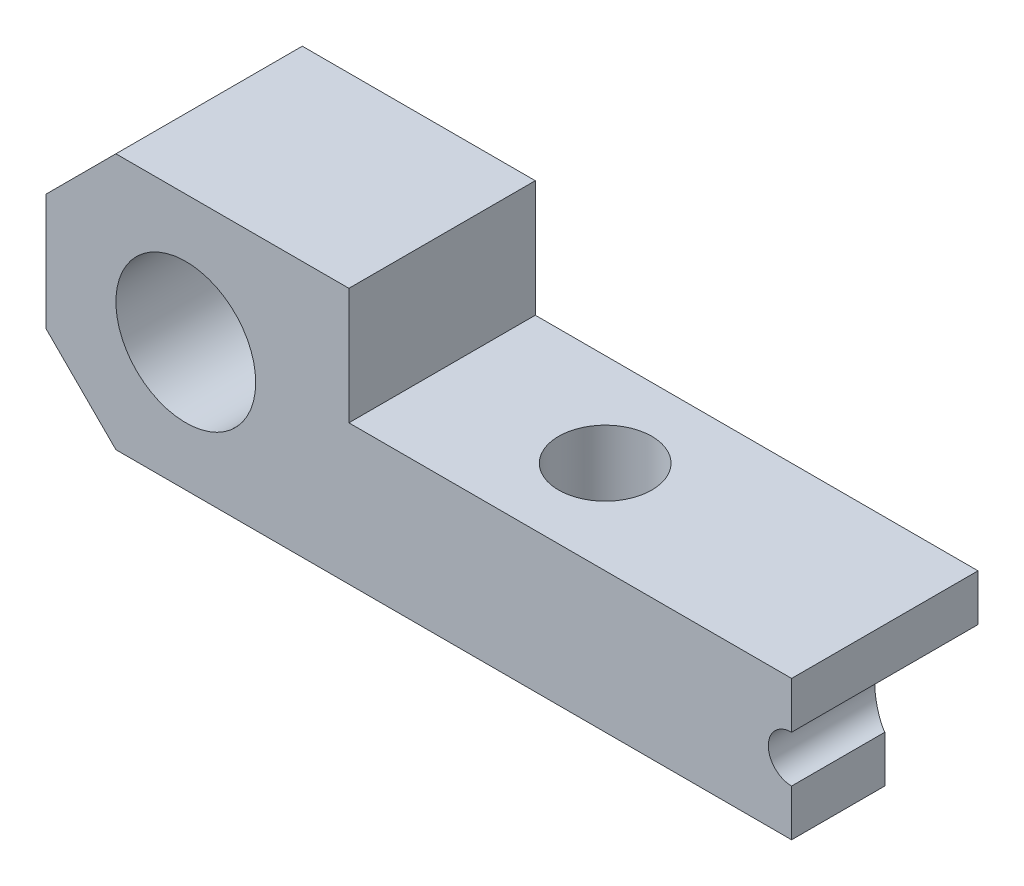
ISO-10303-21;
HEADER;
FILE_DESCRIPTION(('STEP AP214'),'2;1');
FILE_NAME('part.step','',(''),(''),'','','');
FILE_SCHEMA(('AUTOMOTIVE_DESIGN { 1 0 10303 214 1 1 1 1 }'));
ENDSEC;
DATA;
#1=APPLICATION_CONTEXT('core data for automotive mechanical design processes');
#2=APPLICATION_PROTOCOL_DEFINITION('international standard','automotive_design',2000,#1);
#3=PRODUCT_CONTEXT('',#1,'mechanical');
#4=PRODUCT('Part','Part','',(#3));
#5=PRODUCT_RELATED_PRODUCT_CATEGORY('part','',(#4));
#6=PRODUCT_DEFINITION_FORMATION('','',#4);
#7=PRODUCT_DEFINITION_CONTEXT('part definition',#1,'design');
#8=PRODUCT_DEFINITION('design','',#6,#7);
#9=PRODUCT_DEFINITION_SHAPE('','',#8);
#10=(LENGTH_UNIT() NAMED_UNIT(*) SI_UNIT(.MILLI.,.METRE.));
#11=(NAMED_UNIT(*) PLANE_ANGLE_UNIT() SI_UNIT($,.RADIAN.));
#12=(NAMED_UNIT(*) SI_UNIT($,.STERADIAN.) SOLID_ANGLE_UNIT());
#13=UNCERTAINTY_MEASURE_WITH_UNIT(LENGTH_MEASURE(1.E-05),#10,'distance_accuracy_value','');
#14=(GEOMETRIC_REPRESENTATION_CONTEXT(3) GLOBAL_UNCERTAINTY_ASSIGNED_CONTEXT((#13)) GLOBAL_UNIT_ASSIGNED_CONTEXT((#10,
#11,#12)) REPRESENTATION_CONTEXT('',''));
#15=CARTESIAN_POINT('',(0.,0.,0.));
#16=DIRECTION('',(0.,0.,1.));
#17=DIRECTION('',(1.,0.,0.));
#18=AXIS2_PLACEMENT_3D('',#15,#16,#17);
#19=CARTESIAN_POINT('',(32.,0.,8.));
#20=DIRECTION('',(-1.,0.,0.));
#21=DIRECTION('',(0.,0.,1.));
#22=AXIS2_PLACEMENT_3D('',#19,#20,#21);
#23=PLANE('',#22);
#24=DIRECTION('',(0.,0.,-1.));
#25=VECTOR('',#24,1.);
#26=CARTESIAN_POINT('',(32.,0.,8.));
#27=LINE('',#26,#25);
#28=CARTESIAN_POINT('',(32.,0.,8.));
#29=VERTEX_POINT('',#28);
#30=CARTESIAN_POINT('',(32.,0.,4.));
#31=VERTEX_POINT('',#30);
#32=EDGE_CURVE('E152',#29,#31,#27,.T.);
#33=ORIENTED_EDGE('',*,*,#32,.T.);
#34=DIRECTION('',(0.,-1.,0.));
#35=VECTOR('',#34,1.);
#36=CARTESIAN_POINT('',(32.,4.,4.));
#37=LINE('',#36,#35);
#38=CARTESIAN_POINT('',(32.,2.,4.));
#39=VERTEX_POINT('',#38);
#40=EDGE_CURVE('E137',#39,#31,#37,.T.);
#41=ORIENTED_EDGE('',*,*,#40,.F.);
#42=DIRECTION('',(0.,0.,1.));
#43=VECTOR('',#42,1.);
#44=CARTESIAN_POINT('',(32.,2.,0.));
#45=LINE('',#44,#43);
#46=CARTESIAN_POINT('',(32.,2.,8.));
#47=VERTEX_POINT('',#46);
#48=EDGE_CURVE('E145',#39,#47,#45,.T.);
#49=ORIENTED_EDGE('',*,*,#48,.T.);
#50=DIRECTION('',(0.,1.,0.));
#51=VECTOR('',#50,1.);
#52=CARTESIAN_POINT('',(32.,0.,8.));
#53=LINE('',#52,#51);
#54=EDGE_CURVE('E241',#29,#47,#53,.T.);
#55=ORIENTED_EDGE('',*,*,#54,.F.);
#56=EDGE_LOOP('',(#33,#41,#49,#55));
#57=FACE_BOUND('',#56,.T.);
#58=ADVANCED_FACE('F31',(#57),#23,.F.);
#59=CARTESIAN_POINT('',(0.,6.,8.));
#60=DIRECTION('',(0.,0.,1.));
#61=DIRECTION('',(1.,0.,0.));
#62=AXIS2_PLACEMENT_3D('',#59,#60,#61);
#63=PLANE('',#62);
#64=DIRECTION('',(0.,-1.,0.));
#65=VECTOR('',#64,1.);
#66=CARTESIAN_POINT('',(0.,0.,8.));
#67=LINE('',#66,#65);
#68=CARTESIAN_POINT('',(0.,8.00000000000001,8.));
#69=VERTEX_POINT('',#68);
#70=CARTESIAN_POINT('',(0.,3.00000000000001,8.));
#71=VERTEX_POINT('',#70);
#72=EDGE_CURVE('E184',#69,#71,#67,.T.);
#73=ORIENTED_EDGE('',*,*,#72,.T.);
#74=DIRECTION('',(-0.707106781186547,0.707106781186548,0.));
#75=VECTOR('',#74,1.);
#76=CARTESIAN_POINT('',(-1.5,4.50000000000001,8.));
#77=LINE('',#76,#75);
#78=CARTESIAN_POINT('',(3.,0.,8.));
#79=VERTEX_POINT('',#78);
#80=EDGE_CURVE('E39',#71,#79,#77,.F.);
#81=ORIENTED_EDGE('',*,*,#80,.T.);
#82=DIRECTION('',(1.,0.,0.));
#83=VECTOR('',#82,1.);
#84=CARTESIAN_POINT('',(0.,0.,8.));
#85=LINE('',#84,#83);
#86=EDGE_CURVE('E182',#79,#29,#85,.T.);
#87=ORIENTED_EDGE('',*,*,#86,.T.);
#88=ORIENTED_EDGE('',*,*,#54,.T.);
#89=CARTESIAN_POINT('',(32.,3.,8.));
#90=DIRECTION('',(0.,0.,1.));
#91=DIRECTION('',(1.,0.,0.));
#92=AXIS2_PLACEMENT_3D('',#89,#90,#91);
#93=CIRCLE('',#92,0.999999999999998);
#94=CARTESIAN_POINT('',(32.,4.,8.));
#95=VERTEX_POINT('',#94);
#96=EDGE_CURVE('E247',#95,#47,#93,.T.);
#97=ORIENTED_EDGE('',*,*,#96,.F.);
#98=CARTESIAN_POINT('',(32.,6.,8.));
#99=VERTEX_POINT('',#98);
#100=EDGE_CURVE('E151',#95,#99,#53,.T.);
#101=ORIENTED_EDGE('',*,*,#100,.T.);
#102=DIRECTION('',(-1.,0.,0.));
#103=VECTOR('',#102,1.);
#104=CARTESIAN_POINT('',(32.,6.,8.));
#105=LINE('',#104,#103);
#106=CARTESIAN_POINT('',(13.,6.,8.));
#107=VERTEX_POINT('',#106);
#108=EDGE_CURVE('E231',#99,#107,#105,.T.);
#109=ORIENTED_EDGE('',*,*,#108,.T.);
#110=DIRECTION('',(0.,1.,0.));
#111=VECTOR('',#110,1.);
#112=CARTESIAN_POINT('',(13.,11.,8.));
#113=LINE('',#112,#111);
#114=CARTESIAN_POINT('',(13.,11.,8.));
#115=VERTEX_POINT('',#114);
#116=EDGE_CURVE('E240',#107,#115,#113,.T.);
#117=ORIENTED_EDGE('',*,*,#116,.T.);
#118=DIRECTION('',(-1.,0.,0.));
#119=VECTOR('',#118,1.);
#120=CARTESIAN_POINT('',(0.,11.,8.));
#121=LINE('',#120,#119);
#122=CARTESIAN_POINT('',(3.,11.,8.));
#123=VERTEX_POINT('',#122);
#124=EDGE_CURVE('E210',#115,#123,#121,.T.);
#125=ORIENTED_EDGE('',*,*,#124,.T.);
#126=DIRECTION('',(0.707106781186549,0.707106781186546,0.));
#127=VECTOR('',#126,1.);
#128=CARTESIAN_POINT('',(-1.00000000000001,7.,8.));
#129=LINE('',#128,#127);
#130=EDGE_CURVE('E175',#123,#69,#129,.F.);
#131=ORIENTED_EDGE('',*,*,#130,.T.);
#132=EDGE_LOOP('',(#73,#81,#87,#88,#97,#101,#109,#117,#125,#131));
#133=FACE_BOUND('',#132,.T.);
#134=CARTESIAN_POINT('',(6.,5.5,8.));
#135=DIRECTION('',(0.,0.,1.));
#136=DIRECTION('',(1.,0.,0.));
#137=AXIS2_PLACEMENT_3D('',#134,#135,#136);
#138=CIRCLE('',#137,3.);
#139=CARTESIAN_POINT('',(9.,5.5,8.));
#140=VERTEX_POINT('',#139);
#141=EDGE_CURVE('E202',#140,#140,#138,.T.);
#142=ORIENTED_EDGE('',*,*,#141,.F.);
#143=EDGE_LOOP('',(#142));
#144=FACE_BOUND('',#143,.T.);
#145=ADVANCED_FACE('F179',(#133,#144),#63,.T.);
#146=CARTESIAN_POINT('',(0.,6.,0.));
#147=DIRECTION('',(0.,0.,1.));
#148=DIRECTION('',(1.,0.,0.));
#149=AXIS2_PLACEMENT_3D('',#146,#147,#148);
#150=PLANE('',#149);
#151=DIRECTION('',(1.,0.,0.));
#152=VECTOR('',#151,1.);
#153=CARTESIAN_POINT('',(0.,0.,0.));
#154=LINE('',#153,#152);
#155=CARTESIAN_POINT('',(3.,0.,0.));
#156=VERTEX_POINT('',#155);
#157=CARTESIAN_POINT('',(25.,0.,0.));
#158=VERTEX_POINT('',#157);
#159=EDGE_CURVE('E199',#156,#158,#154,.T.);
#160=ORIENTED_EDGE('',*,*,#159,.F.);
#161=DIRECTION('',(0.707106781186547,-0.707106781186548,0.));
#162=VECTOR('',#161,1.);
#163=CARTESIAN_POINT('',(3.,0.,0.));
#164=LINE('',#163,#162);
#165=CARTESIAN_POINT('',(0.,3.00000000000001,0.));
#166=VERTEX_POINT('',#165);
#167=EDGE_CURVE('E169',#156,#166,#164,.F.);
#168=ORIENTED_EDGE('',*,*,#167,.T.);
#169=DIRECTION('',(0.,-1.,0.));
#170=VECTOR('',#169,1.);
#171=CARTESIAN_POINT('',(0.,0.,0.));
#172=LINE('',#171,#170);
#173=CARTESIAN_POINT('',(0.,8.,0.));
#174=VERTEX_POINT('',#173);
#175=EDGE_CURVE('E198',#174,#166,#172,.T.);
#176=ORIENTED_EDGE('',*,*,#175,.F.);
#177=DIRECTION('',(-0.707106781186549,-0.707106781186546,0.));
#178=VECTOR('',#177,1.);
#179=CARTESIAN_POINT('',(0.,8.00000000000001,0.));
#180=LINE('',#179,#178);
#181=CARTESIAN_POINT('',(3.,11.,0.));
#182=VERTEX_POINT('',#181);
#183=EDGE_CURVE('E167',#174,#182,#180,.F.);
#184=ORIENTED_EDGE('',*,*,#183,.T.);
#185=DIRECTION('',(-1.,0.,0.));
#186=VECTOR('',#185,1.);
#187=CARTESIAN_POINT('',(0.,11.,0.));
#188=LINE('',#187,#186);
#189=CARTESIAN_POINT('',(13.,11.,0.));
#190=VERTEX_POINT('',#189);
#191=EDGE_CURVE('E218',#190,#182,#188,.T.);
#192=ORIENTED_EDGE('',*,*,#191,.F.);
#193=DIRECTION('',(0.,1.,0.));
#194=VECTOR('',#193,1.);
#195=CARTESIAN_POINT('',(13.,11.,0.));
#196=LINE('',#195,#194);
#197=CARTESIAN_POINT('',(13.,6.,0.));
#198=VERTEX_POINT('',#197);
#199=EDGE_CURVE('E216',#198,#190,#196,.T.);
#200=ORIENTED_EDGE('',*,*,#199,.F.);
#201=DIRECTION('',(-1.,0.,0.));
#202=VECTOR('',#201,1.);
#203=CARTESIAN_POINT('',(32.,6.,0.));
#204=LINE('',#203,#202);
#205=CARTESIAN_POINT('',(32.,6.,0.));
#206=VERTEX_POINT('',#205);
#207=EDGE_CURVE('E214',#206,#198,#204,.T.);
#208=ORIENTED_EDGE('',*,*,#207,.F.);
#209=DIRECTION('',(0.,1.,0.));
#210=VECTOR('',#209,1.);
#211=CARTESIAN_POINT('',(32.,0.,0.));
#212=LINE('',#211,#210);
#213=CARTESIAN_POINT('',(32.,4.,0.));
#214=VERTEX_POINT('',#213);
#215=EDGE_CURVE('E204',#214,#206,#212,.T.);
#216=ORIENTED_EDGE('',*,*,#215,.F.);
#217=DIRECTION('',(1.,0.,0.));
#218=VECTOR('',#217,1.);
#219=CARTESIAN_POINT('',(32.,4.,0.));
#220=LINE('',#219,#218);
#221=CARTESIAN_POINT('',(25.,4.,0.));
#222=VERTEX_POINT('',#221);
#223=EDGE_CURVE('E124',#222,#214,#220,.T.);
#224=ORIENTED_EDGE('',*,*,#223,.F.);
#225=DIRECTION('',(0.,-1.,0.));
#226=VECTOR('',#225,1.);
#227=CARTESIAN_POINT('',(25.,4.,0.));
#228=LINE('',#227,#226);
#229=EDGE_CURVE('E136',#222,#158,#228,.T.);
#230=ORIENTED_EDGE('',*,*,#229,.T.);
#231=EDGE_LOOP('',(#160,#168,#176,#184,#192,#200,#208,#216,#224,#230));
#232=FACE_BOUND('',#231,.T.);
#233=CARTESIAN_POINT('',(6.,5.5,0.));
#234=DIRECTION('',(0.,0.,1.));
#235=DIRECTION('',(1.,0.,0.));
#236=AXIS2_PLACEMENT_3D('',#233,#234,#235);
#237=CIRCLE('',#236,3.);
#238=CARTESIAN_POINT('',(9.,5.5,0.));
#239=VERTEX_POINT('',#238);
#240=EDGE_CURVE('E207',#239,#239,#237,.T.);
#241=ORIENTED_EDGE('',*,*,#240,.T.);
#242=EDGE_LOOP('',(#241));
#243=FACE_BOUND('',#242,.T.);
#244=ADVANCED_FACE('F196',(#232,#243),#150,.F.);
#245=CARTESIAN_POINT('',(0.,0.,8.));
#246=DIRECTION('',(1.,0.,0.));
#247=DIRECTION('',(0.,1.,0.));
#248=AXIS2_PLACEMENT_3D('',#245,#246,#247);
#249=PLANE('',#248);
#250=ORIENTED_EDGE('',*,*,#175,.T.);
#251=DIRECTION('',(0.,0.,1.));
#252=VECTOR('',#251,1.);
#253=CARTESIAN_POINT('',(0.,3.00000000000001,8.));
#254=LINE('',#253,#252);
#255=EDGE_CURVE('E52',#166,#71,#254,.T.);
#256=ORIENTED_EDGE('',*,*,#255,.T.);
#257=ORIENTED_EDGE('',*,*,#72,.F.);
#258=DIRECTION('',(0.,0.,-1.));
#259=VECTOR('',#258,1.);
#260=CARTESIAN_POINT('',(0.,8.00000000000001,8.));
#261=LINE('',#260,#259);
#262=EDGE_CURVE('E171',#69,#174,#261,.T.);
#263=ORIENTED_EDGE('',*,*,#262,.T.);
#264=EDGE_LOOP('',(#250,#256,#257,#263));
#265=FACE_BOUND('',#264,.T.);
#266=ADVANCED_FACE('F200',(#265),#249,.F.);
#267=CARTESIAN_POINT('',(0.,0.,8.));
#268=DIRECTION('',(0.,1.,0.));
#269=DIRECTION('',(0.,0.,1.));
#270=AXIS2_PLACEMENT_3D('',#267,#268,#269);
#271=PLANE('',#270);
#272=CARTESIAN_POINT('',(20.,0.,4.));
#273=DIRECTION('',(0.,-1.,0.));
#274=DIRECTION('',(0.,0.,-1.));
#275=AXIS2_PLACEMENT_3D('',#272,#273,#274);
#276=CIRCLE('',#275,2.);
#277=CARTESIAN_POINT('',(20.,0.,2.));
#278=VERTEX_POINT('',#277);
#279=EDGE_CURVE('E164',#278,#278,#276,.T.);
#280=ORIENTED_EDGE('',*,*,#279,.F.);
#281=EDGE_LOOP('',(#280));
#282=FACE_BOUND('',#281,.T.);
#283=ORIENTED_EDGE('',*,*,#86,.F.);
#284=DIRECTION('',(0.,0.,-1.));
#285=VECTOR('',#284,1.);
#286=CARTESIAN_POINT('',(3.,0.,8.));
#287=LINE('',#286,#285);
#288=EDGE_CURVE('E146',#79,#156,#287,.T.);
#289=ORIENTED_EDGE('',*,*,#288,.T.);
#290=ORIENTED_EDGE('',*,*,#159,.T.);
#291=DIRECTION('',(-0.868243142124459,0.,-0.496138938356834));
#292=VECTOR('',#291,1.);
#293=CARTESIAN_POINT('',(25.,0.,0.));
#294=LINE('',#293,#292);
#295=EDGE_CURVE('E163',#31,#158,#294,.T.);
#296=ORIENTED_EDGE('',*,*,#295,.F.);
#297=ORIENTED_EDGE('',*,*,#32,.F.);
#298=EDGE_LOOP('',(#283,#289,#290,#296,#297));
#299=FACE_BOUND('',#298,.T.);
#300=ADVANCED_FACE('F188',(#282,#299),#271,.F.);
#301=ORIENTED_EDGE('',*,*,#100,.F.);
#302=DIRECTION('',(0.,0.,1.));
#303=VECTOR('',#302,1.);
#304=CARTESIAN_POINT('',(32.,4.,0.));
#305=LINE('',#304,#303);
#306=CARTESIAN_POINT('',(32.,4.,4.));
#307=VERTEX_POINT('',#306);
#308=EDGE_CURVE('E143',#95,#307,#305,.F.);
#309=ORIENTED_EDGE('',*,*,#308,.T.);
#310=DIRECTION('',(0.,0.,1.));
#311=VECTOR('',#310,1.);
#312=CARTESIAN_POINT('',(32.,4.,4.));
#313=LINE('',#312,#311);
#314=EDGE_CURVE('E119',#214,#307,#313,.T.);
#315=ORIENTED_EDGE('',*,*,#314,.F.);
#316=ORIENTED_EDGE('',*,*,#215,.T.);
#317=DIRECTION('',(0.,0.,-1.));
#318=VECTOR('',#317,1.);
#319=CARTESIAN_POINT('',(32.,6.,8.));
#320=LINE('',#319,#318);
#321=EDGE_CURVE('E156',#99,#206,#320,.T.);
#322=ORIENTED_EDGE('',*,*,#321,.F.);
#323=EDGE_LOOP('',(#301,#309,#315,#316,#322));
#324=FACE_BOUND('',#323,.T.);
#325=ADVANCED_FACE('F149',(#324),#23,.F.);
#326=CARTESIAN_POINT('',(32.,6.,8.));
#327=DIRECTION('',(0.,-1.,0.));
#328=DIRECTION('',(1.,0.,0.));
#329=AXIS2_PLACEMENT_3D('',#326,#327,#328);
#330=PLANE('',#329);
#331=CARTESIAN_POINT('',(20.,6.,4.));
#332=DIRECTION('',(0.,-1.,0.));
#333=DIRECTION('',(1.,0.,0.));
#334=AXIS2_PLACEMENT_3D('',#331,#332,#333);
#335=CIRCLE('',#334,2.);
#336=CARTESIAN_POINT('',(22.,6.,4.));
#337=VERTEX_POINT('',#336);
#338=EDGE_CURVE('E160',#337,#337,#335,.T.);
#339=ORIENTED_EDGE('',*,*,#338,.T.);
#340=EDGE_LOOP('',(#339));
#341=FACE_BOUND('',#340,.T.);
#342=ORIENTED_EDGE('',*,*,#207,.T.);
#343=DIRECTION('',(0.,0.,-1.));
#344=VECTOR('',#343,1.);
#345=CARTESIAN_POINT('',(13.,6.,8.));
#346=LINE('',#345,#344);
#347=EDGE_CURVE('E223',#107,#198,#346,.T.);
#348=ORIENTED_EDGE('',*,*,#347,.F.);
#349=ORIENTED_EDGE('',*,*,#108,.F.);
#350=ORIENTED_EDGE('',*,*,#321,.T.);
#351=EDGE_LOOP('',(#342,#348,#349,#350));
#352=FACE_BOUND('',#351,.T.);
#353=ADVANCED_FACE('F229',(#341,#352),#330,.F.);
#354=CARTESIAN_POINT('',(13.,11.,8.));
#355=DIRECTION('',(-1.,0.,0.));
#356=DIRECTION('',(0.,-1.,0.));
#357=AXIS2_PLACEMENT_3D('',#354,#355,#356);
#358=PLANE('',#357);
#359=ORIENTED_EDGE('',*,*,#199,.T.);
#360=DIRECTION('',(0.,0.,-1.));
#361=VECTOR('',#360,1.);
#362=CARTESIAN_POINT('',(13.,11.,8.));
#363=LINE('',#362,#361);
#364=EDGE_CURVE('E220',#115,#190,#363,.T.);
#365=ORIENTED_EDGE('',*,*,#364,.F.);
#366=ORIENTED_EDGE('',*,*,#116,.F.);
#367=ORIENTED_EDGE('',*,*,#347,.T.);
#368=EDGE_LOOP('',(#359,#365,#366,#367));
#369=FACE_BOUND('',#368,.T.);
#370=ADVANCED_FACE('F236',(#369),#358,.F.);
#371=CARTESIAN_POINT('',(0.,11.,8.));
#372=DIRECTION('',(0.,-1.,0.));
#373=DIRECTION('',(0.,0.,-1.));
#374=AXIS2_PLACEMENT_3D('',#371,#372,#373);
#375=PLANE('',#374);
#376=ORIENTED_EDGE('',*,*,#191,.T.);
#377=DIRECTION('',(0.,0.,1.));
#378=VECTOR('',#377,1.);
#379=CARTESIAN_POINT('',(3.,11.,8.));
#380=LINE('',#379,#378);
#381=EDGE_CURVE('E11',#182,#123,#380,.T.);
#382=ORIENTED_EDGE('',*,*,#381,.T.);
#383=ORIENTED_EDGE('',*,*,#124,.F.);
#384=ORIENTED_EDGE('',*,*,#364,.T.);
#385=EDGE_LOOP('',(#376,#382,#383,#384));
#386=FACE_BOUND('',#385,.T.);
#387=ADVANCED_FACE('F238',(#386),#375,.F.);
#388=CARTESIAN_POINT('',(6.,5.5,8.));
#389=DIRECTION('',(0.,0.,-1.));
#390=DIRECTION('',(-1.,0.,0.));
#391=AXIS2_PLACEMENT_3D('',#388,#389,#390);
#392=CYLINDRICAL_SURFACE('',#391,3.);
#393=ORIENTED_EDGE('',*,*,#141,.T.);
#394=EDGE_LOOP('',(#393));
#395=FACE_BOUND('',#394,.T.);
#396=ORIENTED_EDGE('',*,*,#240,.F.);
#397=EDGE_LOOP('',(#396));
#398=FACE_BOUND('',#397,.T.);
#399=ADVANCED_FACE('F282',(#395,#398),#392,.F.);
#400=CARTESIAN_POINT('',(32.,3.,0.));
#401=DIRECTION('',(0.,0.,1.));
#402=DIRECTION('',(1.,0.,0.));
#403=AXIS2_PLACEMENT_3D('',#400,#401,#402);
#404=CYLINDRICAL_SURFACE('',#403,0.999999999999998);
#405=ORIENTED_EDGE('',*,*,#48,.F.);
#406=CARTESIAN_POINT('',(32.,3.,4.));
#407=DIRECTION('',(-0.496138938356834,0.,0.868243142124459));
#408=DIRECTION('',(0.868243142124459,0.,0.496138938356834));
#409=AXIS2_PLACEMENT_3D('',#406,#407,#408);
#410=ELLIPSE('',#409,1.15175110689979,0.999999999999998);
#411=EDGE_CURVE('E132',#39,#307,#410,.F.);
#412=ORIENTED_EDGE('',*,*,#411,.T.);
#413=ORIENTED_EDGE('',*,*,#308,.F.);
#414=ORIENTED_EDGE('',*,*,#96,.T.);
#415=EDGE_LOOP('',(#405,#412,#413,#414));
#416=FACE_BOUND('',#415,.T.);
#417=ADVANCED_FACE('F141',(#416),#404,.F.);
#418=CARTESIAN_POINT('',(25.,4.,0.));
#419=DIRECTION('',(-0.496138938356834,0.,0.868243142124459));
#420=DIRECTION('',(0.868243142124459,0.,0.496138938356834));
#421=AXIS2_PLACEMENT_3D('',#418,#419,#420);
#422=PLANE('',#421);
#423=ORIENTED_EDGE('',*,*,#40,.T.);
#424=ORIENTED_EDGE('',*,*,#295,.T.);
#425=ORIENTED_EDGE('',*,*,#229,.F.);
#426=DIRECTION('',(-0.868243142124459,0.,-0.496138938356834));
#427=VECTOR('',#426,1.);
#428=CARTESIAN_POINT('',(25.,4.,0.));
#429=LINE('',#428,#427);
#430=EDGE_CURVE('E122',#307,#222,#429,.T.);
#431=ORIENTED_EDGE('',*,*,#430,.F.);
#432=ORIENTED_EDGE('',*,*,#411,.F.);
#433=EDGE_LOOP('',(#423,#424,#425,#431,#432));
#434=FACE_BOUND('',#433,.T.);
#435=ADVANCED_FACE('F131',(#434),#422,.F.);
#436=CARTESIAN_POINT('',(32.,4.,0.));
#437=DIRECTION('',(0.,-1.,0.));
#438=DIRECTION('',(0.,0.,-1.));
#439=AXIS2_PLACEMENT_3D('',#436,#437,#438);
#440=PLANE('',#439);
#441=ORIENTED_EDGE('',*,*,#223,.T.);
#442=ORIENTED_EDGE('',*,*,#314,.T.);
#443=ORIENTED_EDGE('',*,*,#430,.T.);
#444=EDGE_LOOP('',(#441,#442,#443));
#445=FACE_BOUND('',#444,.T.);
#446=ADVANCED_FACE('F121',(#445),#440,.T.);
#447=CARTESIAN_POINT('',(20.,11.,4.));
#448=DIRECTION('',(0.,-1.,0.));
#449=DIRECTION('',(0.,0.,-1.));
#450=AXIS2_PLACEMENT_3D('',#447,#448,#449);
#451=CYLINDRICAL_SURFACE('',#450,2.);
#452=ORIENTED_EDGE('',*,*,#279,.T.);
#453=EDGE_LOOP('',(#452));
#454=FACE_BOUND('',#453,.T.);
#455=ORIENTED_EDGE('',*,*,#338,.F.);
#456=EDGE_LOOP('',(#455));
#457=FACE_BOUND('',#456,.T.);
#458=ADVANCED_FACE('F257',(#454,#457),#451,.F.);
#459=CARTESIAN_POINT('',(3.,0.,8.));
#460=DIRECTION('',(0.707106781186548,0.707106781186547,0.));
#461=DIRECTION('',(-0.707106781186547,0.707106781186548,0.));
#462=AXIS2_PLACEMENT_3D('',#459,#460,#461);
#463=PLANE('',#462);
#464=ORIENTED_EDGE('',*,*,#80,.F.);
#465=ORIENTED_EDGE('',*,*,#255,.F.);
#466=ORIENTED_EDGE('',*,*,#167,.F.);
#467=ORIENTED_EDGE('',*,*,#288,.F.);
#468=EDGE_LOOP('',(#464,#465,#466,#467));
#469=FACE_BOUND('',#468,.T.);
#470=ADVANCED_FACE('F193',(#469),#463,.F.);
#471=CARTESIAN_POINT('',(0.,8.00000000000001,8.));
#472=DIRECTION('',(0.707106781186546,-0.707106781186549,0.));
#473=DIRECTION('',(0.707106781186549,0.707106781186546,0.));
#474=AXIS2_PLACEMENT_3D('',#471,#472,#473);
#475=PLANE('',#474);
#476=ORIENTED_EDGE('',*,*,#130,.F.);
#477=ORIENTED_EDGE('',*,*,#381,.F.);
#478=ORIENTED_EDGE('',*,*,#183,.F.);
#479=ORIENTED_EDGE('',*,*,#262,.F.);
#480=EDGE_LOOP('',(#476,#477,#478,#479));
#481=FACE_BOUND('',#480,.T.);
#482=ADVANCED_FACE('F33',(#481),#475,.F.);
#483=CLOSED_SHELL('',(#58,#145,#244,#266,#300,#325,#353,#370,#387,#399,#417,#435,#446,#458,#470,#482));
#484=MANIFOLD_SOLID_BREP('B2',#483);
#485=ADVANCED_BREP_SHAPE_REPRESENTATION('',(#18,#484),#14);
#486=SHAPE_DEFINITION_REPRESENTATION(#9,#485);
ENDSEC;
END-ISO-10303-21;
